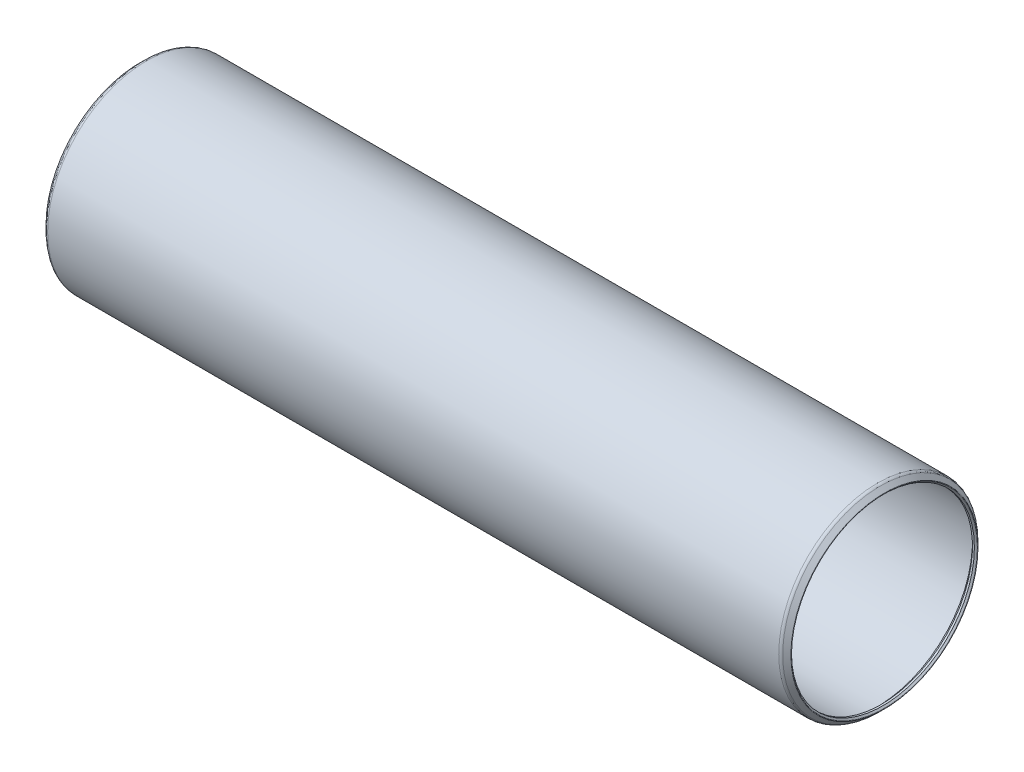
ISO-10303-21;
HEADER;
FILE_DESCRIPTION(('STEP AP214'),'2;1');
FILE_NAME('part.step','',(''),(''),'','','');
FILE_SCHEMA(('AUTOMOTIVE_DESIGN { 1 0 10303 214 1 1 1 1 }'));
ENDSEC;
DATA;
#1=APPLICATION_CONTEXT('core data for automotive mechanical design processes');
#2=APPLICATION_PROTOCOL_DEFINITION('international standard','automotive_design',2000,#1);
#3=PRODUCT_CONTEXT('',#1,'mechanical');
#4=PRODUCT('Part','Part','',(#3));
#5=PRODUCT_RELATED_PRODUCT_CATEGORY('part','',(#4));
#6=PRODUCT_DEFINITION_FORMATION('','',#4);
#7=PRODUCT_DEFINITION_CONTEXT('part definition',#1,'design');
#8=PRODUCT_DEFINITION('design','',#6,#7);
#9=PRODUCT_DEFINITION_SHAPE('','',#8);
#10=(LENGTH_UNIT() NAMED_UNIT(*) SI_UNIT(.MILLI.,.METRE.));
#11=(NAMED_UNIT(*) PLANE_ANGLE_UNIT() SI_UNIT($,.RADIAN.));
#12=(NAMED_UNIT(*) SI_UNIT($,.STERADIAN.) SOLID_ANGLE_UNIT());
#13=UNCERTAINTY_MEASURE_WITH_UNIT(LENGTH_MEASURE(1.E-05),#10,'distance_accuracy_value','');
#14=(GEOMETRIC_REPRESENTATION_CONTEXT(3) GLOBAL_UNCERTAINTY_ASSIGNED_CONTEXT((#13)) GLOBAL_UNIT_ASSIGNED_CONTEXT((#10,
#11,#12)) REPRESENTATION_CONTEXT('',''));
#15=CARTESIAN_POINT('',(0.,0.,0.));
#16=DIRECTION('',(0.,0.,1.));
#17=DIRECTION('',(1.,0.,0.));
#18=AXIS2_PLACEMENT_3D('',#15,#16,#17);
#19=CARTESIAN_POINT('',(197.7898,0.,0.));
#20=DIRECTION('',(-1.,0.,0.));
#21=DIRECTION('',(0.,0.,1.));
#22=AXIS2_PLACEMENT_3D('',#19,#20,#21);
#23=CYLINDRICAL_SURFACE('',#22,25.57145);
#24=CARTESIAN_POINT('',(1.0541,0.,0.));
#25=DIRECTION('',(1.,0.,0.));
#26=DIRECTION('',(0.,0.,-1.));
#27=AXIS2_PLACEMENT_3D('',#24,#25,#26);
#28=CIRCLE('',#27,25.57145);
#29=CARTESIAN_POINT('',(1.0541,0.,-25.57145));
#30=VERTEX_POINT('',#29);
#31=EDGE_CURVE('E117',#30,#30,#28,.F.);
#32=ORIENTED_EDGE('',*,*,#31,.T.);
#33=EDGE_LOOP('',(#32));
#34=FACE_BOUND('',#33,.T.);
#35=CARTESIAN_POINT('',(196.7357,0.,0.));
#36=DIRECTION('',(-1.,0.,0.));
#37=DIRECTION('',(0.,0.,1.));
#38=AXIS2_PLACEMENT_3D('',#35,#36,#37);
#39=CIRCLE('',#38,25.57145);
#40=CARTESIAN_POINT('',(196.7357,0.,25.57145));
#41=VERTEX_POINT('',#40);
#42=EDGE_CURVE('E112',#41,#41,#39,.F.);
#43=ORIENTED_EDGE('',*,*,#42,.T.);
#44=EDGE_LOOP('',(#43));
#45=FACE_BOUND('',#44,.T.);
#46=ADVANCED_FACE('F15',(#34,#45),#23,.F.);
#47=CARTESIAN_POINT('',(1.0541,0.,0.));
#48=DIRECTION('',(1.,0.,0.));
#49=DIRECTION('',(0.,0.,-1.));
#50=AXIS2_PLACEMENT_3D('',#47,#48,#49);
#51=CONICAL_SURFACE('',#50,25.57145,0.785398163397447);
#52=CARTESIAN_POINT('',(0.,0.,0.));
#53=DIRECTION('',(-1.,0.,0.));
#54=DIRECTION('',(0.,0.,1.));
#55=AXIS2_PLACEMENT_3D('',#52,#53,#54);
#56=CIRCLE('',#55,24.51735);
#57=CARTESIAN_POINT('',(0.,0.,24.51735));
#58=VERTEX_POINT('',#57);
#59=EDGE_CURVE('E107',#58,#58,#56,.T.);
#60=ORIENTED_EDGE('',*,*,#59,.T.);
#61=EDGE_LOOP('',(#60));
#62=FACE_BOUND('',#61,.T.);
#63=ORIENTED_EDGE('',*,*,#31,.F.);
#64=EDGE_LOOP('',(#63));
#65=FACE_BOUND('',#64,.T.);
#66=ADVANCED_FACE('F124',(#62,#65),#51,.F.);
#67=CARTESIAN_POINT('',(196.7357,0.,0.));
#68=DIRECTION('',(-1.,0.,0.));
#69=DIRECTION('',(0.,-1.,0.));
#70=AXIS2_PLACEMENT_3D('',#67,#68,#69);
#71=CONICAL_SURFACE('',#70,25.57145,0.785398163397434);
#72=ORIENTED_EDGE('',*,*,#42,.F.);
#73=EDGE_LOOP('',(#72));
#74=FACE_BOUND('',#73,.T.);
#75=CARTESIAN_POINT('',(197.7898,0.,0.));
#76=DIRECTION('',(-1.,0.,0.));
#77=DIRECTION('',(0.,0.,1.));
#78=AXIS2_PLACEMENT_3D('',#75,#76,#77);
#79=CIRCLE('',#78,24.51735);
#80=CARTESIAN_POINT('',(197.7898,0.,24.51735));
#81=VERTEX_POINT('',#80);
#82=EDGE_CURVE('E102',#81,#81,#79,.F.);
#83=ORIENTED_EDGE('',*,*,#82,.T.);
#84=EDGE_LOOP('',(#83));
#85=FACE_BOUND('',#84,.T.);
#86=ADVANCED_FACE('F126',(#74,#85),#71,.F.);
#87=CARTESIAN_POINT('',(197.7898,0.,0.));
#88=DIRECTION('',(-1.,0.,0.));
#89=DIRECTION('',(0.,0.,1.));
#90=AXIS2_PLACEMENT_3D('',#87,#88,#89);
#91=CYLINDRICAL_SURFACE('',#90,24.51735);
#92=CARTESIAN_POINT('',(-0.527050000000001,0.,0.));
#93=DIRECTION('',(-1.,0.,0.));
#94=DIRECTION('',(0.,0.,1.));
#95=AXIS2_PLACEMENT_3D('',#92,#93,#94);
#96=CIRCLE('',#95,24.51735);
#97=CARTESIAN_POINT('',(-0.527050000000001,0.,24.51735));
#98=VERTEX_POINT('',#97);
#99=EDGE_CURVE('E97',#98,#98,#96,.T.);
#100=ORIENTED_EDGE('',*,*,#99,.T.);
#101=EDGE_LOOP('',(#100));
#102=FACE_BOUND('',#101,.T.);
#103=ORIENTED_EDGE('',*,*,#59,.F.);
#104=EDGE_LOOP('',(#103));
#105=FACE_BOUND('',#104,.T.);
#106=ADVANCED_FACE('F133',(#102,#105),#91,.F.);
#107=CARTESIAN_POINT('',(197.7898,0.,0.));
#108=DIRECTION('',(-1.,0.,0.));
#109=DIRECTION('',(0.,0.,1.));
#110=AXIS2_PLACEMENT_3D('',#107,#108,#109);
#111=CYLINDRICAL_SURFACE('',#110,24.51735);
#112=ORIENTED_EDGE('',*,*,#82,.F.);
#113=EDGE_LOOP('',(#112));
#114=FACE_BOUND('',#113,.T.);
#115=CARTESIAN_POINT('',(198.31685,0.,0.));
#116=DIRECTION('',(1.,0.,0.));
#117=DIRECTION('',(0.,0.,-1.));
#118=AXIS2_PLACEMENT_3D('',#115,#116,#117);
#119=CIRCLE('',#118,24.51735);
#120=CARTESIAN_POINT('',(198.31685,0.,-24.51735));
#121=VERTEX_POINT('',#120);
#122=EDGE_CURVE('E92',#121,#121,#119,.T.);
#123=ORIENTED_EDGE('',*,*,#122,.T.);
#124=EDGE_LOOP('',(#123));
#125=FACE_BOUND('',#124,.T.);
#126=ADVANCED_FACE('F153',(#114,#125),#111,.F.);
#127=CARTESIAN_POINT('',(-0.919083696838046,0.,0.));
#128=DIRECTION('',(-1.,0.,0.));
#129=DIRECTION('',(0.,-1.,0.));
#130=AXIS2_PLACEMENT_3D('',#127,#128,#129);
#131=CONICAL_SURFACE('',#130,24.909383696838,0.785398163397453);
#132=CARTESIAN_POINT('',(-0.919083696838046,0.,0.));
#133=DIRECTION('',(1.,0.,0.));
#134=DIRECTION('',(0.,0.,-1.));
#135=AXIS2_PLACEMENT_3D('',#132,#133,#134);
#136=CIRCLE('',#135,24.909383696838);
#137=CARTESIAN_POINT('',(-0.919083696838046,0.,-24.909383696838));
#138=VERTEX_POINT('',#137);
#139=EDGE_CURVE('E89',#138,#138,#136,.T.);
#140=ORIENTED_EDGE('',*,*,#139,.F.);
#141=EDGE_LOOP('',(#140));
#142=FACE_BOUND('',#141,.T.);
#143=ORIENTED_EDGE('',*,*,#99,.F.);
#144=EDGE_LOOP('',(#143));
#145=FACE_BOUND('',#144,.T.);
#146=ADVANCED_FACE('F150',(#142,#145),#131,.F.);
#147=CARTESIAN_POINT('',(198.708883696838,0.,0.));
#148=DIRECTION('',(1.,0.,0.));
#149=DIRECTION('',(0.,1.,0.));
#150=AXIS2_PLACEMENT_3D('',#147,#148,#149);
#151=CONICAL_SURFACE('',#150,24.9093836968381,0.785398163397448);
#152=ORIENTED_EDGE('',*,*,#122,.F.);
#153=EDGE_LOOP('',(#152));
#154=FACE_BOUND('',#153,.T.);
#155=CARTESIAN_POINT('',(198.708883696838,0.,0.));
#156=DIRECTION('',(1.,0.,0.));
#157=DIRECTION('',(0.,0.,-1.));
#158=AXIS2_PLACEMENT_3D('',#155,#156,#157);
#159=CIRCLE('',#158,24.9093836968381);
#160=CARTESIAN_POINT('',(198.708883696838,0.,-24.9093836968381));
#161=VERTEX_POINT('',#160);
#162=EDGE_CURVE('E67',#161,#161,#159,.F.);
#163=ORIENTED_EDGE('',*,*,#162,.F.);
#164=EDGE_LOOP('',(#163));
#165=FACE_BOUND('',#164,.T.);
#166=ADVANCED_FACE('F83',(#154,#165),#151,.F.);
#167=CARTESIAN_POINT('',(-0.829281135627363,0.,0.));
#168=DIRECTION('',(1.,0.,0.));
#169=DIRECTION('',(0.,0.,-1.));
#170=AXIS2_PLACEMENT_3D('',#167,#168,#169);
#171=TOROIDAL_SURFACE('',#170,24.9991862580487,0.126999999999997);
#172=CARTESIAN_POINT('',(-0.919083696838019,0.,0.));
#173=DIRECTION('',(1.,0.,0.));
#174=DIRECTION('',(0.,0.,-1.));
#175=AXIS2_PLACEMENT_3D('',#172,#173,#174);
#176=CIRCLE('',#175,25.0889888192594);
#177=CARTESIAN_POINT('',(-0.919083696838018,0.,-25.0889888192594));
#178=VERTEX_POINT('',#177);
#179=EDGE_CURVE('E62',#178,#178,#176,.T.);
#180=ORIENTED_EDGE('',*,*,#179,.F.);
#181=EDGE_LOOP('',(#180));
#182=FACE_BOUND('',#181,.T.);
#183=ORIENTED_EDGE('',*,*,#139,.T.);
#184=EDGE_LOOP('',(#183));
#185=FACE_BOUND('',#184,.T.);
#186=ADVANCED_FACE('F78',(#182,#185),#171,.T.);
#187=CARTESIAN_POINT('',(198.619081135627,0.,0.));
#188=DIRECTION('',(1.,0.,0.));
#189=DIRECTION('',(0.,0.,-1.));
#190=AXIS2_PLACEMENT_3D('',#187,#188,#189);
#191=TOROIDAL_SURFACE('',#190,24.9991862580487,0.127000000000013);
#192=ORIENTED_EDGE('',*,*,#162,.T.);
#193=EDGE_LOOP('',(#192));
#194=FACE_BOUND('',#193,.T.);
#195=CARTESIAN_POINT('',(198.708883696838,0.,0.));
#196=DIRECTION('',(-1.,0.,0.));
#197=DIRECTION('',(0.,0.,1.));
#198=AXIS2_PLACEMENT_3D('',#195,#196,#197);
#199=CIRCLE('',#198,25.0889888192594);
#200=CARTESIAN_POINT('',(198.708883696838,0.,25.0889888192594));
#201=VERTEX_POINT('',#200);
#202=EDGE_CURVE('E57',#201,#201,#199,.T.);
#203=ORIENTED_EDGE('',*,*,#202,.F.);
#204=EDGE_LOOP('',(#203));
#205=FACE_BOUND('',#204,.T.);
#206=ADVANCED_FACE('F74',(#194,#205),#191,.T.);
#207=CARTESIAN_POINT('',(0.16903874195126,0.,0.));
#208=DIRECTION('',(1.,0.,0.));
#209=DIRECTION('',(0.,1.,0.));
#210=AXIS2_PLACEMENT_3D('',#207,#208,#209);
#211=CONICAL_SURFACE('',#210,26.1771112580487,0.785398163397447);
#212=CARTESIAN_POINT('',(0.169038741951243,0.,0.));
#213=DIRECTION('',(1.,0.,0.));
#214=DIRECTION('',(0.,0.,-1.));
#215=AXIS2_PLACEMENT_3D('',#212,#213,#214);
#216=CIRCLE('',#215,26.1771112580487);
#217=CARTESIAN_POINT('',(0.169038741951243,0.,-26.1771112580487));
#218=VERTEX_POINT('',#217);
#219=EDGE_CURVE('E54',#218,#218,#216,.T.);
#220=ORIENTED_EDGE('',*,*,#219,.F.);
#221=EDGE_LOOP('',(#220));
#222=FACE_BOUND('',#221,.T.);
#223=ORIENTED_EDGE('',*,*,#179,.T.);
#224=EDGE_LOOP('',(#223));
#225=FACE_BOUND('',#224,.T.);
#226=ADVANCED_FACE('F77',(#222,#225),#211,.T.);
#227=CARTESIAN_POINT('',(197.620761258049,0.,0.));
#228=DIRECTION('',(-1.,0.,0.));
#229=DIRECTION('',(0.,-1.,0.));
#230=AXIS2_PLACEMENT_3D('',#227,#228,#229);
#231=CONICAL_SURFACE('',#230,26.1771112580487,0.785398163397447);
#232=ORIENTED_EDGE('',*,*,#202,.T.);
#233=EDGE_LOOP('',(#232));
#234=FACE_BOUND('',#233,.T.);
#235=CARTESIAN_POINT('',(197.620761258049,0.,0.));
#236=DIRECTION('',(1.,0.,0.));
#237=DIRECTION('',(0.,0.,-1.));
#238=AXIS2_PLACEMENT_3D('',#235,#236,#237);
#239=CIRCLE('',#238,26.1771112580487);
#240=CARTESIAN_POINT('',(197.620761258049,0.,-26.1771112580487));
#241=VERTEX_POINT('',#240);
#242=EDGE_CURVE('E27',#241,#241,#239,.F.);
#243=ORIENTED_EDGE('',*,*,#242,.F.);
#244=EDGE_LOOP('',(#243));
#245=FACE_BOUND('',#244,.T.);
#246=ADVANCED_FACE('F48',(#234,#245),#231,.T.);
#247=CARTESIAN_POINT('',(0.9144,0.,0.));
#248=DIRECTION('',(1.,0.,0.));
#249=DIRECTION('',(0.,0.,-1.));
#250=AXIS2_PLACEMENT_3D('',#247,#248,#249);
#251=TOROIDAL_SURFACE('',#250,25.43175,1.05409999999999);
#252=CARTESIAN_POINT('',(0.914399999999982,0.,0.));
#253=DIRECTION('',(-1.,0.,0.));
#254=DIRECTION('',(0.,0.,1.));
#255=AXIS2_PLACEMENT_3D('',#252,#253,#254);
#256=CIRCLE('',#255,26.48585);
#257=CARTESIAN_POINT('',(0.914399999999982,0.,26.48585));
#258=VERTEX_POINT('',#257);
#259=EDGE_CURVE('E22',#258,#258,#256,.F.);
#260=ORIENTED_EDGE('',*,*,#259,.F.);
#261=EDGE_LOOP('',(#260));
#262=FACE_BOUND('',#261,.T.);
#263=ORIENTED_EDGE('',*,*,#219,.T.);
#264=EDGE_LOOP('',(#263));
#265=FACE_BOUND('',#264,.T.);
#266=ADVANCED_FACE('F43',(#262,#265),#251,.T.);
#267=CARTESIAN_POINT('',(196.8754,0.,0.));
#268=DIRECTION('',(1.,0.,0.));
#269=DIRECTION('',(0.,0.,-1.));
#270=AXIS2_PLACEMENT_3D('',#267,#268,#269);
#271=TOROIDAL_SURFACE('',#270,25.43175,1.05409999999996);
#272=ORIENTED_EDGE('',*,*,#242,.T.);
#273=EDGE_LOOP('',(#272));
#274=FACE_BOUND('',#273,.T.);
#275=CARTESIAN_POINT('',(196.8754,0.,0.));
#276=DIRECTION('',(-1.,0.,0.));
#277=DIRECTION('',(0.,0.,1.));
#278=AXIS2_PLACEMENT_3D('',#275,#276,#277);
#279=CIRCLE('',#278,26.48585);
#280=CARTESIAN_POINT('',(196.8754,0.,26.48585));
#281=VERTEX_POINT('',#280);
#282=EDGE_CURVE('E10',#281,#281,#279,.T.);
#283=ORIENTED_EDGE('',*,*,#282,.F.);
#284=EDGE_LOOP('',(#283));
#285=FACE_BOUND('',#284,.T.);
#286=ADVANCED_FACE('F38',(#274,#285),#271,.T.);
#287=CARTESIAN_POINT('',(197.7898,0.,0.));
#288=DIRECTION('',(-1.,0.,0.));
#289=DIRECTION('',(0.,0.,1.));
#290=AXIS2_PLACEMENT_3D('',#287,#288,#289);
#291=CYLINDRICAL_SURFACE('',#290,26.48585);
#292=ORIENTED_EDGE('',*,*,#282,.T.);
#293=EDGE_LOOP('',(#292));
#294=FACE_BOUND('',#293,.T.);
#295=ORIENTED_EDGE('',*,*,#259,.T.);
#296=EDGE_LOOP('',(#295));
#297=FACE_BOUND('',#296,.T.);
#298=ADVANCED_FACE('F42',(#294,#297),#291,.T.);
#299=CLOSED_SHELL('',(#46,#66,#86,#106,#126,#146,#166,#186,#206,#226,#246,#266,#286,#298));
#300=MANIFOLD_SOLID_BREP('B1',#299);
#301=ADVANCED_BREP_SHAPE_REPRESENTATION('',(#18,#300),#14);
#302=SHAPE_DEFINITION_REPRESENTATION(#9,#301);
ENDSEC;
END-ISO-10303-21;
